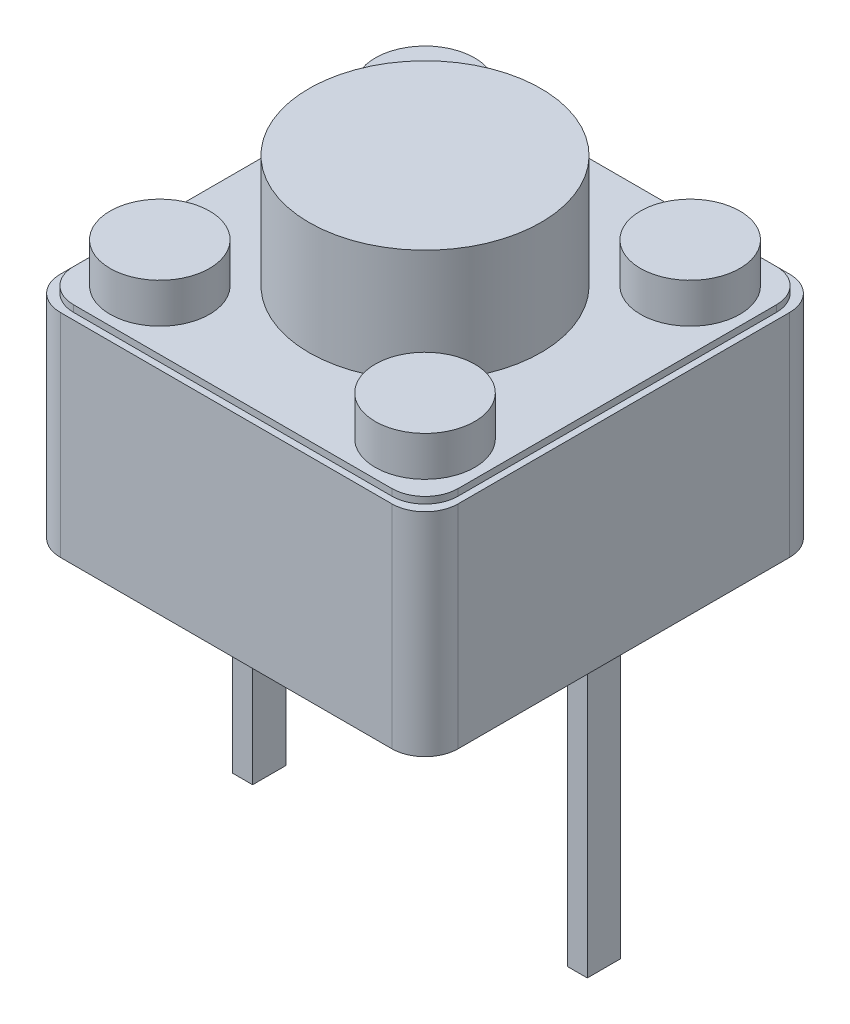
ISO-10303-21;
HEADER;
FILE_DESCRIPTION(('STEP AP214'),'2;1');
FILE_NAME('part.step','',(''),(''),'','','');
FILE_SCHEMA(('AUTOMOTIVE_DESIGN { 1 0 10303 214 1 1 1 1 }'));
ENDSEC;
DATA;
#1=APPLICATION_CONTEXT('core data for automotive mechanical design processes');
#2=APPLICATION_PROTOCOL_DEFINITION('international standard','automotive_design',2000,#1);
#3=PRODUCT_CONTEXT('',#1,'mechanical');
#4=PRODUCT('Part','Part','',(#3));
#5=PRODUCT_RELATED_PRODUCT_CATEGORY('part','',(#4));
#6=PRODUCT_DEFINITION_FORMATION('','',#4);
#7=PRODUCT_DEFINITION_CONTEXT('part definition',#1,'design');
#8=PRODUCT_DEFINITION('design','',#6,#7);
#9=PRODUCT_DEFINITION_SHAPE('','',#8);
#10=(LENGTH_UNIT() NAMED_UNIT(*) SI_UNIT(.MILLI.,.METRE.));
#11=(NAMED_UNIT(*) PLANE_ANGLE_UNIT() SI_UNIT($,.RADIAN.));
#12=(NAMED_UNIT(*) SI_UNIT($,.STERADIAN.) SOLID_ANGLE_UNIT());
#13=UNCERTAINTY_MEASURE_WITH_UNIT(LENGTH_MEASURE(1.E-05),#10,'distance_accuracy_value','');
#14=(GEOMETRIC_REPRESENTATION_CONTEXT(3) GLOBAL_UNCERTAINTY_ASSIGNED_CONTEXT((#13)) GLOBAL_UNIT_ASSIGNED_CONTEXT((#10,
#11,#12)) REPRESENTATION_CONTEXT('',''));
#15=CARTESIAN_POINT('',(0.,0.,0.));
#16=DIRECTION('',(0.,0.,1.));
#17=DIRECTION('',(1.,0.,0.));
#18=AXIS2_PLACEMENT_3D('',#15,#16,#17);
#19=CARTESIAN_POINT('',(-7.00000000000001,5.,-7.27272727272732));
#20=DIRECTION('',(0.,1.,0.));
#21=DIRECTION('',(0.,0.,1.));
#22=AXIS2_PLACEMENT_3D('',#19,#20,#21);
#23=PLANE('',#22);
#24=CARTESIAN_POINT('',(-7.00000000000001,5.,-7.27272727272732));
#25=DIRECTION('',(0.,1.,0.));
#26=DIRECTION('',(0.,0.,1.));
#27=AXIS2_PLACEMENT_3D('',#24,#25,#26);
#28=CIRCLE('',#27,1.75);
#29=CARTESIAN_POINT('',(-7.00000000000001,5.,-5.52272727272732));
#30=VERTEX_POINT('',#29);
#31=EDGE_CURVE('E11',#30,#30,#28,.T.);
#32=ORIENTED_EDGE('',*,*,#31,.T.);
#33=EDGE_LOOP('',(#32));
#34=FACE_BOUND('',#33,.T.);
#35=ADVANCED_FACE('F51',(#34),#23,.T.);
#36=CARTESIAN_POINT('',(-7.00000000000001,5.,-7.27272727272732));
#37=DIRECTION('',(0.,-1.,0.));
#38=DIRECTION('',(0.,0.,-1.));
#39=AXIS2_PLACEMENT_3D('',#36,#37,#38);
#40=CYLINDRICAL_SURFACE('',#39,1.75);
#41=ORIENTED_EDGE('',*,*,#31,.F.);
#42=EDGE_LOOP('',(#41));
#43=FACE_BOUND('',#42,.T.);
#44=CARTESIAN_POINT('',(-7.00000000000001,3.3,-7.27272727272732));
#45=DIRECTION('',(0.,1.,0.));
#46=DIRECTION('',(0.,0.,1.));
#47=AXIS2_PLACEMENT_3D('',#44,#45,#46);
#48=CIRCLE('',#47,1.75);
#49=CARTESIAN_POINT('',(-7.00000000000001,3.3,-5.52272727272732));
#50=VERTEX_POINT('',#49);
#51=EDGE_CURVE('E60',#50,#50,#48,.T.);
#52=ORIENTED_EDGE('',*,*,#51,.T.);
#53=EDGE_LOOP('',(#52));
#54=FACE_BOUND('',#53,.T.);
#55=ADVANCED_FACE('F53',(#43,#54),#40,.T.);
#56=CARTESIAN_POINT('',(-10.,3.4,-10.2727272727273));
#57=DIRECTION('',(1.,0.,0.));
#58=DIRECTION('',(0.,0.,-1.));
#59=AXIS2_PLACEMENT_3D('',#56,#57,#58);
#60=PLANE('',#59);
#61=DIRECTION('',(0.,0.,1.));
#62=VECTOR('',#61,1.);
#63=CARTESIAN_POINT('',(-10.,3.2,-10.2727272727273));
#64=LINE('',#63,#62);
#65=CARTESIAN_POINT('',(-10.,3.2,-9.77272727272731));
#66=VERTEX_POINT('',#65);
#67=CARTESIAN_POINT('',(-10.,3.2,-4.77272727272732));
#68=VERTEX_POINT('',#67);
#69=EDGE_CURVE('E303',#66,#68,#64,.T.);
#70=ORIENTED_EDGE('',*,*,#69,.F.);
#71=DIRECTION('',(0.,-1.,0.));
#72=VECTOR('',#71,1.);
#73=CARTESIAN_POINT('',(-10.,3.4,-9.77272727272731));
#74=LINE('',#73,#72);
#75=CARTESIAN_POINT('',(-10.,0.,-9.77272727272731));
#76=VERTEX_POINT('',#75);
#77=EDGE_CURVE('E343',#66,#76,#74,.T.);
#78=ORIENTED_EDGE('',*,*,#77,.T.);
#79=DIRECTION('',(0.,0.,1.));
#80=VECTOR('',#79,1.);
#81=CARTESIAN_POINT('',(-10.,0.,-10.2727272727273));
#82=LINE('',#81,#80);
#83=CARTESIAN_POINT('',(-10.,0.,-4.77272727272732));
#84=VERTEX_POINT('',#83);
#85=EDGE_CURVE('E284',#76,#84,#82,.T.);
#86=ORIENTED_EDGE('',*,*,#85,.T.);
#87=DIRECTION('',(0.,-1.,0.));
#88=VECTOR('',#87,1.);
#89=CARTESIAN_POINT('',(-10.,3.4,-4.77272727272732));
#90=LINE('',#89,#88);
#91=EDGE_CURVE('E341',#84,#68,#90,.F.);
#92=ORIENTED_EDGE('',*,*,#91,.T.);
#93=EDGE_LOOP('',(#70,#78,#86,#92));
#94=FACE_BOUND('',#93,.T.);
#95=ADVANCED_FACE('F463',(#94),#60,.F.);
#96=CARTESIAN_POINT('',(-10.,3.4,-4.27272727272732));
#97=DIRECTION('',(0.,0.,-1.));
#98=DIRECTION('',(-1.,0.,0.));
#99=AXIS2_PLACEMENT_3D('',#96,#97,#98);
#100=PLANE('',#99);
#101=DIRECTION('',(1.,0.,0.));
#102=VECTOR('',#101,1.);
#103=CARTESIAN_POINT('',(-10.,3.2,-4.27272727272732));
#104=LINE('',#103,#102);
#105=CARTESIAN_POINT('',(-9.50000000000001,3.2,-4.27272727272732));
#106=VERTEX_POINT('',#105);
#107=CARTESIAN_POINT('',(-4.50000000000001,3.2,-4.27272727272732));
#108=VERTEX_POINT('',#107);
#109=EDGE_CURVE('E301',#106,#108,#104,.T.);
#110=ORIENTED_EDGE('',*,*,#109,.F.);
#111=DIRECTION('',(0.,-1.,0.));
#112=VECTOR('',#111,1.);
#113=CARTESIAN_POINT('',(-9.50000000000001,3.4,-4.27272727272732));
#114=LINE('',#113,#112);
#115=CARTESIAN_POINT('',(-9.50000000000001,0.,-4.27272727272732));
#116=VERTEX_POINT('',#115);
#117=EDGE_CURVE('E372',#106,#116,#114,.T.);
#118=ORIENTED_EDGE('',*,*,#117,.T.);
#119=DIRECTION('',(1.,0.,0.));
#120=VECTOR('',#119,1.);
#121=CARTESIAN_POINT('',(-10.,0.,-4.27272727272732));
#122=LINE('',#121,#120);
#123=CARTESIAN_POINT('',(-4.50000000000001,0.,-4.27272727272732));
#124=VERTEX_POINT('',#123);
#125=EDGE_CURVE('E287',#116,#124,#122,.T.);
#126=ORIENTED_EDGE('',*,*,#125,.T.);
#127=DIRECTION('',(0.,-1.,0.));
#128=VECTOR('',#127,1.);
#129=CARTESIAN_POINT('',(-4.50000000000001,3.4,-4.27272727272732));
#130=LINE('',#129,#128);
#131=EDGE_CURVE('E370',#124,#108,#130,.F.);
#132=ORIENTED_EDGE('',*,*,#131,.T.);
#133=EDGE_LOOP('',(#110,#118,#126,#132));
#134=FACE_BOUND('',#133,.T.);
#135=ADVANCED_FACE('F500',(#134),#100,.F.);
#136=CARTESIAN_POINT('',(-4.00000000000001,3.4,-10.2727272727273));
#137=DIRECTION('',(-1.,0.,0.));
#138=DIRECTION('',(0.,0.,1.));
#139=AXIS2_PLACEMENT_3D('',#136,#137,#138);
#140=PLANE('',#139);
#141=DIRECTION('',(0.,0.,-1.));
#142=VECTOR('',#141,1.);
#143=CARTESIAN_POINT('',(-4.00000000000001,0.,-10.2727272727273));
#144=LINE('',#143,#142);
#145=CARTESIAN_POINT('',(-4.00000000000001,0.,-4.77272727272732));
#146=VERTEX_POINT('',#145);
#147=CARTESIAN_POINT('',(-4.00000000000001,0.,-9.77272727272731));
#148=VERTEX_POINT('',#147);
#149=EDGE_CURVE('E291',#146,#148,#144,.T.);
#150=ORIENTED_EDGE('',*,*,#149,.T.);
#151=DIRECTION('',(0.,-1.,0.));
#152=VECTOR('',#151,1.);
#153=CARTESIAN_POINT('',(-4.00000000000001,3.4,-9.77272727272731));
#154=LINE('',#153,#152);
#155=CARTESIAN_POINT('',(-4.00000000000001,3.2,-9.77272727272731));
#156=VERTEX_POINT('',#155);
#157=EDGE_CURVE('E67',#148,#156,#154,.F.);
#158=ORIENTED_EDGE('',*,*,#157,.T.);
#159=DIRECTION('',(0.,0.,-1.));
#160=VECTOR('',#159,1.);
#161=CARTESIAN_POINT('',(-4.00000000000001,3.2,-10.2727272727273));
#162=LINE('',#161,#160);
#163=CARTESIAN_POINT('',(-4.00000000000001,3.2,-4.77272727272732));
#164=VERTEX_POINT('',#163);
#165=EDGE_CURVE('E299',#164,#156,#162,.T.);
#166=ORIENTED_EDGE('',*,*,#165,.F.);
#167=DIRECTION('',(0.,-1.,0.));
#168=VECTOR('',#167,1.);
#169=CARTESIAN_POINT('',(-4.00000000000001,3.4,-4.77272727272732));
#170=LINE('',#169,#168);
#171=EDGE_CURVE('E366',#164,#146,#170,.T.);
#172=ORIENTED_EDGE('',*,*,#171,.T.);
#173=EDGE_LOOP('',(#150,#158,#166,#172));
#174=FACE_BOUND('',#173,.T.);
#175=ADVANCED_FACE('F454',(#174),#140,.F.);
#176=CARTESIAN_POINT('',(-10.,3.4,-10.2727272727273));
#177=DIRECTION('',(0.,0.,1.));
#178=DIRECTION('',(1.,0.,0.));
#179=AXIS2_PLACEMENT_3D('',#176,#177,#178);
#180=PLANE('',#179);
#181=DIRECTION('',(-1.,0.,0.));
#182=VECTOR('',#181,1.);
#183=CARTESIAN_POINT('',(-10.,0.,-10.2727272727273));
#184=LINE('',#183,#182);
#185=CARTESIAN_POINT('',(-4.50000000000001,0.,-10.2727272727273));
#186=VERTEX_POINT('',#185);
#187=CARTESIAN_POINT('',(-9.50000000000001,0.,-10.2727272727273));
#188=VERTEX_POINT('',#187);
#189=EDGE_CURVE('E264',#186,#188,#184,.T.);
#190=ORIENTED_EDGE('',*,*,#189,.T.);
#191=DIRECTION('',(0.,-1.,0.));
#192=VECTOR('',#191,1.);
#193=CARTESIAN_POINT('',(-9.50000000000001,3.4,-10.2727272727273));
#194=LINE('',#193,#192);
#195=CARTESIAN_POINT('',(-9.50000000000001,3.2,-10.2727272727273));
#196=VERTEX_POINT('',#195);
#197=EDGE_CURVE('E357',#188,#196,#194,.F.);
#198=ORIENTED_EDGE('',*,*,#197,.T.);
#199=DIRECTION('',(-1.,0.,0.));
#200=VECTOR('',#199,1.);
#201=CARTESIAN_POINT('',(-10.,3.2,-10.2727272727273));
#202=LINE('',#201,#200);
#203=CARTESIAN_POINT('',(-4.50000000000001,3.2,-10.2727272727273));
#204=VERTEX_POINT('',#203);
#205=EDGE_CURVE('E295',#204,#196,#202,.T.);
#206=ORIENTED_EDGE('',*,*,#205,.F.);
#207=DIRECTION('',(0.,-1.,0.));
#208=VECTOR('',#207,1.);
#209=CARTESIAN_POINT('',(-4.50000000000001,3.4,-10.2727272727273));
#210=LINE('',#209,#208);
#211=EDGE_CURVE('E354',#204,#186,#210,.T.);
#212=ORIENTED_EDGE('',*,*,#211,.T.);
#213=EDGE_LOOP('',(#190,#198,#206,#212));
#214=FACE_BOUND('',#213,.T.);
#215=ADVANCED_FACE('F443',(#214),#180,.F.);
#216=CARTESIAN_POINT('',(0.,0.,0.));
#217=DIRECTION('',(0.,1.,0.));
#218=DIRECTION('',(0.,0.,1.));
#219=AXIS2_PLACEMENT_3D('',#216,#217,#218);
#220=PLANE('',#219);
#221=DIRECTION('',(0.,0.,-1.));
#222=VECTOR('',#221,1.);
#223=CARTESIAN_POINT('',(-9.65000000000001,0.,-7.52272727272731));
#224=LINE('',#223,#222);
#225=CARTESIAN_POINT('',(-9.65000000000001,0.,-7.02272727272731));
#226=VERTEX_POINT('',#225);
#227=CARTESIAN_POINT('',(-9.65000000000001,0.,-7.52272727272731));
#228=VERTEX_POINT('',#227);
#229=EDGE_CURVE('E260',#226,#228,#224,.T.);
#230=ORIENTED_EDGE('',*,*,#229,.F.);
#231=DIRECTION('',(-1.,0.,0.));
#232=VECTOR('',#231,1.);
#233=CARTESIAN_POINT('',(-9.35000000000001,0.,-7.02272727272731));
#234=LINE('',#233,#232);
#235=CARTESIAN_POINT('',(-9.35000000000001,0.,-7.02272727272731));
#236=VERTEX_POINT('',#235);
#237=EDGE_CURVE('E273',#236,#226,#234,.T.);
#238=ORIENTED_EDGE('',*,*,#237,.F.);
#239=DIRECTION('',(0.,0.,1.));
#240=VECTOR('',#239,1.);
#241=CARTESIAN_POINT('',(-9.35000000000001,0.,-7.52272727272731));
#242=LINE('',#241,#240);
#243=CARTESIAN_POINT('',(-9.35000000000001,0.,-7.52272727272731));
#244=VERTEX_POINT('',#243);
#245=EDGE_CURVE('E269',#244,#236,#242,.T.);
#246=ORIENTED_EDGE('',*,*,#245,.F.);
#247=DIRECTION('',(1.,0.,0.));
#248=VECTOR('',#247,1.);
#249=CARTESIAN_POINT('',(-9.35000000000001,0.,-7.52272727272731));
#250=LINE('',#249,#248);
#251=EDGE_CURVE('E265',#228,#244,#250,.T.);
#252=ORIENTED_EDGE('',*,*,#251,.F.);
#253=EDGE_LOOP('',(#230,#238,#246,#252));
#254=FACE_BOUND('',#253,.T.);
#255=ORIENTED_EDGE('',*,*,#85,.F.);
#256=CARTESIAN_POINT('',(-9.50000000000001,0.,-9.77272727272731));
#257=DIRECTION('',(0.,1.,0.));
#258=DIRECTION('',(0.,0.,1.));
#259=AXIS2_PLACEMENT_3D('',#256,#257,#258);
#260=CIRCLE('',#259,0.5);
#261=EDGE_CURVE('E352',#76,#188,#260,.F.);
#262=ORIENTED_EDGE('',*,*,#261,.T.);
#263=ORIENTED_EDGE('',*,*,#189,.F.);
#264=CARTESIAN_POINT('',(-4.50000000000001,0.,-9.77272727272731));
#265=DIRECTION('',(0.,1.,0.));
#266=DIRECTION('',(0.,0.,1.));
#267=AXIS2_PLACEMENT_3D('',#264,#265,#266);
#268=CIRCLE('',#267,0.5);
#269=EDGE_CURVE('E350',#186,#148,#268,.F.);
#270=ORIENTED_EDGE('',*,*,#269,.T.);
#271=ORIENTED_EDGE('',*,*,#149,.F.);
#272=CARTESIAN_POINT('',(-4.50000000000001,0.,-4.77272727272732));
#273=DIRECTION('',(0.,1.,0.));
#274=DIRECTION('',(0.,0.,1.));
#275=AXIS2_PLACEMENT_3D('',#272,#273,#274);
#276=CIRCLE('',#275,0.5);
#277=EDGE_CURVE('E346',#146,#124,#276,.F.);
#278=ORIENTED_EDGE('',*,*,#277,.T.);
#279=ORIENTED_EDGE('',*,*,#125,.F.);
#280=CARTESIAN_POINT('',(-9.50000000000001,0.,-4.77272727272732));
#281=DIRECTION('',(0.,1.,0.));
#282=DIRECTION('',(0.,0.,1.));
#283=AXIS2_PLACEMENT_3D('',#280,#281,#282);
#284=CIRCLE('',#283,0.5);
#285=EDGE_CURVE('E348',#116,#84,#284,.F.);
#286=ORIENTED_EDGE('',*,*,#285,.T.);
#287=EDGE_LOOP('',(#255,#262,#263,#270,#271,#278,#279,#286));
#288=FACE_BOUND('',#287,.T.);
#289=DIRECTION('',(0.,0.,-1.));
#290=VECTOR('',#289,1.);
#291=CARTESIAN_POINT('',(-4.60208585615651,0.,-7.52272727272731));
#292=LINE('',#291,#290);
#293=CARTESIAN_POINT('',(-4.60208585615651,0.,-7.02272727272731));
#294=VERTEX_POINT('',#293);
#295=CARTESIAN_POINT('',(-4.60208585615651,0.,-7.52272727272731));
#296=VERTEX_POINT('',#295);
#297=EDGE_CURVE('E239',#294,#296,#292,.T.);
#298=ORIENTED_EDGE('',*,*,#297,.F.);
#299=DIRECTION('',(-1.,0.,0.));
#300=VECTOR('',#299,1.);
#301=CARTESIAN_POINT('',(-4.30208585615651,0.,-7.02272727272731));
#302=LINE('',#301,#300);
#303=CARTESIAN_POINT('',(-4.30208585615651,0.,-7.02272727272731));
#304=VERTEX_POINT('',#303);
#305=EDGE_CURVE('E430',#304,#294,#302,.T.);
#306=ORIENTED_EDGE('',*,*,#305,.F.);
#307=DIRECTION('',(0.,0.,1.));
#308=VECTOR('',#307,1.);
#309=CARTESIAN_POINT('',(-4.30208585615651,0.,-7.52272727272731));
#310=LINE('',#309,#308);
#311=CARTESIAN_POINT('',(-4.30208585615651,0.,-7.52272727272731));
#312=VERTEX_POINT('',#311);
#313=EDGE_CURVE('E240',#312,#304,#310,.T.);
#314=ORIENTED_EDGE('',*,*,#313,.F.);
#315=DIRECTION('',(1.,0.,0.));
#316=VECTOR('',#315,1.);
#317=CARTESIAN_POINT('',(-4.30208585615651,0.,-7.52272727272731));
#318=LINE('',#317,#316);
#319=EDGE_CURVE('E241',#296,#312,#318,.T.);
#320=ORIENTED_EDGE('',*,*,#319,.F.);
#321=EDGE_LOOP('',(#298,#306,#314,#320));
#322=FACE_BOUND('',#321,.T.);
#323=ADVANCED_FACE('F440',(#254,#288,#322),#220,.F.);
#324=CARTESIAN_POINT('',(-9.65000000000001,-4.27,-7.52272727272731));
#325=DIRECTION('',(1.,0.,0.));
#326=DIRECTION('',(0.,0.,-1.));
#327=AXIS2_PLACEMENT_3D('',#324,#325,#326);
#328=PLANE('',#327);
#329=ORIENTED_EDGE('',*,*,#229,.T.);
#330=DIRECTION('',(0.,1.,0.));
#331=VECTOR('',#330,1.);
#332=CARTESIAN_POINT('',(-9.65000000000001,-4.27,-7.52272727272731));
#333=LINE('',#332,#331);
#334=CARTESIAN_POINT('',(-9.65000000000001,-4.27,-7.52272727272731));
#335=VERTEX_POINT('',#334);
#336=EDGE_CURVE('E268',#335,#228,#333,.T.);
#337=ORIENTED_EDGE('',*,*,#336,.F.);
#338=DIRECTION('',(0.,0.,-1.));
#339=VECTOR('',#338,1.);
#340=CARTESIAN_POINT('',(-9.65000000000001,-4.27,-7.52272727272731));
#341=LINE('',#340,#339);
#342=CARTESIAN_POINT('',(-9.65000000000001,-4.27,-7.02272727272731));
#343=VERTEX_POINT('',#342);
#344=EDGE_CURVE('E250',#343,#335,#341,.T.);
#345=ORIENTED_EDGE('',*,*,#344,.F.);
#346=DIRECTION('',(0.,1.,0.));
#347=VECTOR('',#346,1.);
#348=CARTESIAN_POINT('',(-9.65000000000001,-4.27,-7.02272727272731));
#349=LINE('',#348,#347);
#350=EDGE_CURVE('E263',#343,#226,#349,.T.);
#351=ORIENTED_EDGE('',*,*,#350,.T.);
#352=EDGE_LOOP('',(#329,#337,#345,#351));
#353=FACE_BOUND('',#352,.T.);
#354=ADVANCED_FACE('F442',(#353),#328,.F.);
#355=CARTESIAN_POINT('',(-9.35000000000001,-4.27,-7.52272727272731));
#356=DIRECTION('',(0.,0.,1.));
#357=DIRECTION('',(1.,0.,0.));
#358=AXIS2_PLACEMENT_3D('',#355,#356,#357);
#359=PLANE('',#358);
#360=ORIENTED_EDGE('',*,*,#251,.T.);
#361=DIRECTION('',(0.,1.,0.));
#362=VECTOR('',#361,1.);
#363=CARTESIAN_POINT('',(-9.35000000000001,-4.27,-7.52272727272731));
#364=LINE('',#363,#362);
#365=CARTESIAN_POINT('',(-9.35000000000001,-4.27,-7.52272727272731));
#366=VERTEX_POINT('',#365);
#367=EDGE_CURVE('E272',#366,#244,#364,.T.);
#368=ORIENTED_EDGE('',*,*,#367,.F.);
#369=DIRECTION('',(1.,0.,0.));
#370=VECTOR('',#369,1.);
#371=CARTESIAN_POINT('',(-9.35000000000001,-4.27,-7.52272727272731));
#372=LINE('',#371,#370);
#373=EDGE_CURVE('E253',#335,#366,#372,.T.);
#374=ORIENTED_EDGE('',*,*,#373,.F.);
#375=ORIENTED_EDGE('',*,*,#336,.T.);
#376=EDGE_LOOP('',(#360,#368,#374,#375));
#377=FACE_BOUND('',#376,.T.);
#378=ADVANCED_FACE('F451',(#377),#359,.F.);
#379=CARTESIAN_POINT('',(-9.35000000000001,-4.27,-7.52272727272731));
#380=DIRECTION('',(-1.,0.,0.));
#381=DIRECTION('',(0.,0.,1.));
#382=AXIS2_PLACEMENT_3D('',#379,#380,#381);
#383=PLANE('',#382);
#384=ORIENTED_EDGE('',*,*,#245,.T.);
#385=DIRECTION('',(0.,1.,0.));
#386=VECTOR('',#385,1.);
#387=CARTESIAN_POINT('',(-9.35000000000001,-4.27,-7.02272727272731));
#388=LINE('',#387,#386);
#389=CARTESIAN_POINT('',(-9.35000000000001,-4.27,-7.02272727272731));
#390=VERTEX_POINT('',#389);
#391=EDGE_CURVE('E254',#390,#236,#388,.T.);
#392=ORIENTED_EDGE('',*,*,#391,.F.);
#393=DIRECTION('',(0.,0.,1.));
#394=VECTOR('',#393,1.);
#395=CARTESIAN_POINT('',(-9.35000000000001,-4.27,-7.52272727272731));
#396=LINE('',#395,#394);
#397=EDGE_CURVE('E256',#366,#390,#396,.T.);
#398=ORIENTED_EDGE('',*,*,#397,.F.);
#399=ORIENTED_EDGE('',*,*,#367,.T.);
#400=EDGE_LOOP('',(#384,#392,#398,#399));
#401=FACE_BOUND('',#400,.T.);
#402=ADVANCED_FACE('F826',(#401),#383,.F.);
#403=CARTESIAN_POINT('',(-9.35000000000001,-4.27,-7.02272727272731));
#404=DIRECTION('',(0.,0.,-1.));
#405=DIRECTION('',(-1.,0.,0.));
#406=AXIS2_PLACEMENT_3D('',#403,#404,#405);
#407=PLANE('',#406);
#408=ORIENTED_EDGE('',*,*,#237,.T.);
#409=ORIENTED_EDGE('',*,*,#350,.F.);
#410=DIRECTION('',(-1.,0.,0.));
#411=VECTOR('',#410,1.);
#412=CARTESIAN_POINT('',(-9.35000000000001,-4.27,-7.02272727272731));
#413=LINE('',#412,#411);
#414=EDGE_CURVE('E258',#390,#343,#413,.T.);
#415=ORIENTED_EDGE('',*,*,#414,.F.);
#416=ORIENTED_EDGE('',*,*,#391,.T.);
#417=EDGE_LOOP('',(#408,#409,#415,#416));
#418=FACE_BOUND('',#417,.T.);
#419=ADVANCED_FACE('F818',(#418),#407,.F.);
#420=CARTESIAN_POINT('',(0.,-4.27,0.));
#421=DIRECTION('',(0.,-1.,0.));
#422=DIRECTION('',(0.,0.,-1.));
#423=AXIS2_PLACEMENT_3D('',#420,#421,#422);
#424=PLANE('',#423);
#425=ORIENTED_EDGE('',*,*,#344,.T.);
#426=ORIENTED_EDGE('',*,*,#373,.T.);
#427=ORIENTED_EDGE('',*,*,#397,.T.);
#428=ORIENTED_EDGE('',*,*,#414,.T.);
#429=EDGE_LOOP('',(#425,#426,#427,#428));
#430=FACE_BOUND('',#429,.T.);
#431=ADVANCED_FACE('F811',(#430),#424,.T.);
#432=CARTESIAN_POINT('',(-4.60208585615651,-4.27,-7.52272727272731));
#433=DIRECTION('',(1.,0.,0.));
#434=DIRECTION('',(0.,0.,-1.));
#435=AXIS2_PLACEMENT_3D('',#432,#433,#434);
#436=PLANE('',#435);
#437=ORIENTED_EDGE('',*,*,#297,.T.);
#438=DIRECTION('',(0.,1.,0.));
#439=VECTOR('',#438,1.);
#440=CARTESIAN_POINT('',(-4.60208585615651,-4.27,-7.52272727272731));
#441=LINE('',#440,#439);
#442=CARTESIAN_POINT('',(-4.60208585615651,-4.27,-7.52272727272731));
#443=VERTEX_POINT('',#442);
#444=EDGE_CURVE('E220',#443,#296,#441,.T.);
#445=ORIENTED_EDGE('',*,*,#444,.F.);
#446=DIRECTION('',(0.,0.,-1.));
#447=VECTOR('',#446,1.);
#448=CARTESIAN_POINT('',(-4.60208585615651,-4.27,-7.52272727272731));
#449=LINE('',#448,#447);
#450=CARTESIAN_POINT('',(-4.60208585615651,-4.27,-7.02272727272731));
#451=VERTEX_POINT('',#450);
#452=EDGE_CURVE('E227',#451,#443,#449,.T.);
#453=ORIENTED_EDGE('',*,*,#452,.F.);
#454=DIRECTION('',(0.,1.,0.));
#455=VECTOR('',#454,1.);
#456=CARTESIAN_POINT('',(-4.60208585615651,-4.27,-7.02272727272731));
#457=LINE('',#456,#455);
#458=EDGE_CURVE('E245',#451,#294,#457,.T.);
#459=ORIENTED_EDGE('',*,*,#458,.T.);
#460=EDGE_LOOP('',(#437,#445,#453,#459));
#461=FACE_BOUND('',#460,.T.);
#462=ADVANCED_FACE('F238',(#461),#436,.F.);
#463=CARTESIAN_POINT('',(-4.30208585615651,-4.27,-7.52272727272731));
#464=DIRECTION('',(0.,0.,1.));
#465=DIRECTION('',(1.,0.,0.));
#466=AXIS2_PLACEMENT_3D('',#463,#464,#465);
#467=PLANE('',#466);
#468=ORIENTED_EDGE('',*,*,#319,.T.);
#469=DIRECTION('',(0.,1.,0.));
#470=VECTOR('',#469,1.);
#471=CARTESIAN_POINT('',(-4.30208585615651,-4.27,-7.52272727272731));
#472=LINE('',#471,#470);
#473=CARTESIAN_POINT('',(-4.30208585615651,-4.27,-7.52272727272731));
#474=VERTEX_POINT('',#473);
#475=EDGE_CURVE('E223',#474,#312,#472,.T.);
#476=ORIENTED_EDGE('',*,*,#475,.F.);
#477=DIRECTION('',(1.,0.,0.));
#478=VECTOR('',#477,1.);
#479=CARTESIAN_POINT('',(-4.30208585615651,-4.27,-7.52272727272731));
#480=LINE('',#479,#478);
#481=EDGE_CURVE('E215',#443,#474,#480,.T.);
#482=ORIENTED_EDGE('',*,*,#481,.F.);
#483=ORIENTED_EDGE('',*,*,#444,.T.);
#484=EDGE_LOOP('',(#468,#476,#482,#483));
#485=FACE_BOUND('',#484,.T.);
#486=ADVANCED_FACE('F218',(#485),#467,.F.);
#487=CARTESIAN_POINT('',(-4.30208585615651,-4.27,-7.52272727272731));
#488=DIRECTION('',(-1.,0.,0.));
#489=DIRECTION('',(0.,0.,1.));
#490=AXIS2_PLACEMENT_3D('',#487,#488,#489);
#491=PLANE('',#490);
#492=ORIENTED_EDGE('',*,*,#313,.T.);
#493=DIRECTION('',(0.,1.,0.));
#494=VECTOR('',#493,1.);
#495=CARTESIAN_POINT('',(-4.30208585615651,-4.27,-7.02272727272731));
#496=LINE('',#495,#494);
#497=CARTESIAN_POINT('',(-4.30208585615651,-4.27,-7.02272727272731));
#498=VERTEX_POINT('',#497);
#499=EDGE_CURVE('E236',#498,#304,#496,.T.);
#500=ORIENTED_EDGE('',*,*,#499,.F.);
#501=DIRECTION('',(0.,0.,1.));
#502=VECTOR('',#501,1.);
#503=CARTESIAN_POINT('',(-4.30208585615651,-4.27,-7.52272727272731));
#504=LINE('',#503,#502);
#505=EDGE_CURVE('E226',#474,#498,#504,.T.);
#506=ORIENTED_EDGE('',*,*,#505,.F.);
#507=ORIENTED_EDGE('',*,*,#475,.T.);
#508=EDGE_LOOP('',(#492,#500,#506,#507));
#509=FACE_BOUND('',#508,.T.);
#510=ADVANCED_FACE('F438',(#509),#491,.F.);
#511=CARTESIAN_POINT('',(-4.30208585615651,-4.27,-7.02272727272731));
#512=DIRECTION('',(0.,0.,-1.));
#513=DIRECTION('',(-1.,0.,0.));
#514=AXIS2_PLACEMENT_3D('',#511,#512,#513);
#515=PLANE('',#514);
#516=ORIENTED_EDGE('',*,*,#305,.T.);
#517=ORIENTED_EDGE('',*,*,#458,.F.);
#518=DIRECTION('',(-1.,0.,0.));
#519=VECTOR('',#518,1.);
#520=CARTESIAN_POINT('',(-4.30208585615651,-4.27,-7.02272727272731));
#521=LINE('',#520,#519);
#522=EDGE_CURVE('E232',#498,#451,#521,.T.);
#523=ORIENTED_EDGE('',*,*,#522,.F.);
#524=ORIENTED_EDGE('',*,*,#499,.T.);
#525=EDGE_LOOP('',(#516,#517,#523,#524));
#526=FACE_BOUND('',#525,.T.);
#527=ADVANCED_FACE('F436',(#526),#515,.F.);
#528=CARTESIAN_POINT('',(0.,-4.27,0.));
#529=DIRECTION('',(0.,-1.,0.));
#530=DIRECTION('',(0.,0.,-1.));
#531=AXIS2_PLACEMENT_3D('',#528,#529,#530);
#532=PLANE('',#531);
#533=ORIENTED_EDGE('',*,*,#452,.T.);
#534=ORIENTED_EDGE('',*,*,#481,.T.);
#535=ORIENTED_EDGE('',*,*,#505,.T.);
#536=ORIENTED_EDGE('',*,*,#522,.T.);
#537=EDGE_LOOP('',(#533,#534,#535,#536));
#538=FACE_BOUND('',#537,.T.);
#539=ADVANCED_FACE('F230',(#538),#532,.T.);
#540=CARTESIAN_POINT('',(0.,3.2,0.));
#541=DIRECTION('',(0.,1.,0.));
#542=DIRECTION('',(0.,0.,1.));
#543=AXIS2_PLACEMENT_3D('',#540,#541,#542);
#544=PLANE('',#543);
#545=DIRECTION('',(0.,0.,1.));
#546=VECTOR('',#545,1.);
#547=CARTESIAN_POINT('',(-9.90000000000001,3.2,-10.1727272727273));
#548=LINE('',#547,#546);
#549=CARTESIAN_POINT('',(-9.90000000000001,3.2,-9.67272727272731));
#550=VERTEX_POINT('',#549);
#551=CARTESIAN_POINT('',(-9.90000000000001,3.2,-4.87272727272731));
#552=VERTEX_POINT('',#551);
#553=EDGE_CURVE('E404',#550,#552,#548,.T.);
#554=ORIENTED_EDGE('',*,*,#553,.F.);
#555=CARTESIAN_POINT('',(-9.40000000000001,3.2,-9.67272727272731));
#556=DIRECTION('',(0.,1.,0.));
#557=DIRECTION('',(0.,0.,1.));
#558=AXIS2_PLACEMENT_3D('',#555,#556,#557);
#559=CIRCLE('',#558,0.5);
#560=CARTESIAN_POINT('',(-9.40000000000001,3.2,-10.1727272727273));
#561=VERTEX_POINT('',#560);
#562=EDGE_CURVE('E333',#550,#561,#559,.F.);
#563=ORIENTED_EDGE('',*,*,#562,.T.);
#564=DIRECTION('',(-1.,0.,0.));
#565=VECTOR('',#564,1.);
#566=CARTESIAN_POINT('',(-9.90000000000001,3.2,-10.1727272727273));
#567=LINE('',#566,#565);
#568=CARTESIAN_POINT('',(-4.60000000000001,3.2,-10.1727272727273));
#569=VERTEX_POINT('',#568);
#570=EDGE_CURVE('E425',#569,#561,#567,.T.);
#571=ORIENTED_EDGE('',*,*,#570,.F.);
#572=CARTESIAN_POINT('',(-4.60000000000001,3.2,-9.67272727272731));
#573=DIRECTION('',(0.,1.,0.));
#574=DIRECTION('',(0.,0.,1.));
#575=AXIS2_PLACEMENT_3D('',#572,#573,#574);
#576=CIRCLE('',#575,0.5);
#577=CARTESIAN_POINT('',(-4.10000000000001,3.2,-9.67272727272731));
#578=VERTEX_POINT('',#577);
#579=EDGE_CURVE('E339',#569,#578,#576,.F.);
#580=ORIENTED_EDGE('',*,*,#579,.T.);
#581=DIRECTION('',(0.,0.,-1.));
#582=VECTOR('',#581,1.);
#583=CARTESIAN_POINT('',(-4.10000000000001,3.2,-10.1727272727273));
#584=LINE('',#583,#582);
#585=CARTESIAN_POINT('',(-4.10000000000001,3.2,-4.87272727272731));
#586=VERTEX_POINT('',#585);
#587=EDGE_CURVE('E416',#586,#578,#584,.T.);
#588=ORIENTED_EDGE('',*,*,#587,.F.);
#589=CARTESIAN_POINT('',(-4.60000000000001,3.2,-4.87272727272731));
#590=DIRECTION('',(0.,1.,0.));
#591=DIRECTION('',(0.,0.,1.));
#592=AXIS2_PLACEMENT_3D('',#589,#590,#591);
#593=CIRCLE('',#592,0.5);
#594=CARTESIAN_POINT('',(-4.60000000000001,3.2,-4.37272727272732));
#595=VERTEX_POINT('',#594);
#596=EDGE_CURVE('E337',#586,#595,#593,.F.);
#597=ORIENTED_EDGE('',*,*,#596,.T.);
#598=DIRECTION('',(1.,0.,0.));
#599=VECTOR('',#598,1.);
#600=CARTESIAN_POINT('',(-9.90000000000001,3.2,-4.37272727272732));
#601=LINE('',#600,#599);
#602=CARTESIAN_POINT('',(-9.40000000000001,3.2,-4.37272727272732));
#603=VERTEX_POINT('',#602);
#604=EDGE_CURVE('E412',#603,#595,#601,.T.);
#605=ORIENTED_EDGE('',*,*,#604,.F.);
#606=CARTESIAN_POINT('',(-9.40000000000001,3.2,-4.87272727272731));
#607=DIRECTION('',(0.,1.,0.));
#608=DIRECTION('',(0.,0.,1.));
#609=AXIS2_PLACEMENT_3D('',#606,#607,#608);
#610=CIRCLE('',#609,0.5);
#611=EDGE_CURVE('E335',#603,#552,#610,.F.);
#612=ORIENTED_EDGE('',*,*,#611,.T.);
#613=EDGE_LOOP('',(#554,#563,#571,#580,#588,#597,#605,#612));
#614=FACE_BOUND('',#613,.T.);
#615=ORIENTED_EDGE('',*,*,#205,.T.);
#616=CARTESIAN_POINT('',(-9.50000000000001,3.2,-9.77272727272731));
#617=DIRECTION('',(0.,1.,0.));
#618=DIRECTION('',(0.,0.,1.));
#619=AXIS2_PLACEMENT_3D('',#616,#617,#618);
#620=CIRCLE('',#619,0.5);
#621=EDGE_CURVE('E364',#196,#66,#620,.T.);
#622=ORIENTED_EDGE('',*,*,#621,.T.);
#623=ORIENTED_EDGE('',*,*,#69,.T.);
#624=CARTESIAN_POINT('',(-9.50000000000001,3.2,-4.77272727272732));
#625=DIRECTION('',(0.,1.,0.));
#626=DIRECTION('',(0.,0.,1.));
#627=AXIS2_PLACEMENT_3D('',#624,#625,#626);
#628=CIRCLE('',#627,0.5);
#629=EDGE_CURVE('E360',#68,#106,#628,.T.);
#630=ORIENTED_EDGE('',*,*,#629,.T.);
#631=ORIENTED_EDGE('',*,*,#109,.T.);
#632=CARTESIAN_POINT('',(-4.50000000000001,3.2,-4.77272727272732));
#633=DIRECTION('',(0.,1.,0.));
#634=DIRECTION('',(0.,0.,1.));
#635=AXIS2_PLACEMENT_3D('',#632,#633,#634);
#636=CIRCLE('',#635,0.5);
#637=EDGE_CURVE('E74',#108,#164,#636,.T.);
#638=ORIENTED_EDGE('',*,*,#637,.T.);
#639=ORIENTED_EDGE('',*,*,#165,.T.);
#640=CARTESIAN_POINT('',(-4.50000000000001,3.2,-9.77272727272731));
#641=DIRECTION('',(0.,1.,0.));
#642=DIRECTION('',(0.,0.,1.));
#643=AXIS2_PLACEMENT_3D('',#640,#641,#642);
#644=CIRCLE('',#643,0.5);
#645=EDGE_CURVE('E362',#156,#204,#644,.T.);
#646=ORIENTED_EDGE('',*,*,#645,.T.);
#647=EDGE_LOOP('',(#615,#622,#623,#630,#631,#638,#639,#646));
#648=FACE_BOUND('',#647,.T.);
#649=ADVANCED_FACE('F408',(#614,#648),#544,.T.);
#650=CARTESIAN_POINT('',(-9.90000000000001,3.3,-10.1727272727273));
#651=DIRECTION('',(1.,0.,0.));
#652=DIRECTION('',(0.,0.,-1.));
#653=AXIS2_PLACEMENT_3D('',#650,#651,#652);
#654=PLANE('',#653);
#655=DIRECTION('',(0.,0.,1.));
#656=VECTOR('',#655,1.);
#657=CARTESIAN_POINT('',(-9.90000000000001,3.3,-10.1727272727273));
#658=LINE('',#657,#656);
#659=CARTESIAN_POINT('',(-9.90000000000001,3.3,-9.67272727272731));
#660=VERTEX_POINT('',#659);
#661=CARTESIAN_POINT('',(-9.90000000000001,3.3,-4.87272727272731));
#662=VERTEX_POINT('',#661);
#663=EDGE_CURVE('E406',#660,#662,#658,.T.);
#664=ORIENTED_EDGE('',*,*,#663,.F.);
#665=DIRECTION('',(0.,-1.,0.));
#666=VECTOR('',#665,1.);
#667=CARTESIAN_POINT('',(-9.90000000000001,3.3,-9.67272727272731));
#668=LINE('',#667,#666);
#669=EDGE_CURVE('E307',#660,#550,#668,.T.);
#670=ORIENTED_EDGE('',*,*,#669,.T.);
#671=ORIENTED_EDGE('',*,*,#553,.T.);
#672=DIRECTION('',(0.,-1.,0.));
#673=VECTOR('',#672,1.);
#674=CARTESIAN_POINT('',(-9.90000000000001,3.3,-4.87272727272731));
#675=LINE('',#674,#673);
#676=EDGE_CURVE('E298',#552,#662,#675,.F.);
#677=ORIENTED_EDGE('',*,*,#676,.T.);
#678=EDGE_LOOP('',(#664,#670,#671,#677));
#679=FACE_BOUND('',#678,.T.);
#680=ADVANCED_FACE('F403',(#679),#654,.F.);
#681=CARTESIAN_POINT('',(-9.90000000000001,3.3,-4.37272727272732));
#682=DIRECTION('',(0.,0.,-1.));
#683=DIRECTION('',(-1.,0.,0.));
#684=AXIS2_PLACEMENT_3D('',#681,#682,#683);
#685=PLANE('',#684);
#686=DIRECTION('',(1.,0.,0.));
#687=VECTOR('',#686,1.);
#688=CARTESIAN_POINT('',(-9.90000000000001,3.3,-4.37272727272732));
#689=LINE('',#688,#687);
#690=CARTESIAN_POINT('',(-9.40000000000001,3.3,-4.37272727272732));
#691=VERTEX_POINT('',#690);
#692=CARTESIAN_POINT('',(-4.60000000000001,3.3,-4.37272727272732));
#693=VERTEX_POINT('',#692);
#694=EDGE_CURVE('E980',#691,#693,#689,.T.);
#695=ORIENTED_EDGE('',*,*,#694,.F.);
#696=DIRECTION('',(0.,-1.,0.));
#697=VECTOR('',#696,1.);
#698=CARTESIAN_POINT('',(-9.40000000000001,3.3,-4.37272727272732));
#699=LINE('',#698,#697);
#700=EDGE_CURVE('E325',#691,#603,#699,.T.);
#701=ORIENTED_EDGE('',*,*,#700,.T.);
#702=ORIENTED_EDGE('',*,*,#604,.T.);
#703=DIRECTION('',(0.,-1.,0.));
#704=VECTOR('',#703,1.);
#705=CARTESIAN_POINT('',(-4.60000000000001,3.3,-4.37272727272732));
#706=LINE('',#705,#704);
#707=EDGE_CURVE('E323',#595,#693,#706,.F.);
#708=ORIENTED_EDGE('',*,*,#707,.T.);
#709=EDGE_LOOP('',(#695,#701,#702,#708));
#710=FACE_BOUND('',#709,.T.);
#711=ADVANCED_FACE('F762',(#710),#685,.F.);
#712=CARTESIAN_POINT('',(-4.10000000000001,3.3,-10.1727272727273));
#713=DIRECTION('',(-1.,0.,0.));
#714=DIRECTION('',(0.,0.,1.));
#715=AXIS2_PLACEMENT_3D('',#712,#713,#714);
#716=PLANE('',#715);
#717=DIRECTION('',(0.,0.,-1.));
#718=VECTOR('',#717,1.);
#719=CARTESIAN_POINT('',(-4.10000000000001,3.3,-10.1727272727273));
#720=LINE('',#719,#718);
#721=CARTESIAN_POINT('',(-4.10000000000001,3.3,-4.87272727272731));
#722=VERTEX_POINT('',#721);
#723=CARTESIAN_POINT('',(-4.10000000000001,3.3,-9.67272727272731));
#724=VERTEX_POINT('',#723);
#725=EDGE_CURVE('E395',#722,#724,#720,.T.);
#726=ORIENTED_EDGE('',*,*,#725,.F.);
#727=DIRECTION('',(0.,-1.,0.));
#728=VECTOR('',#727,1.);
#729=CARTESIAN_POINT('',(-4.10000000000001,3.3,-4.87272727272731));
#730=LINE('',#729,#728);
#731=EDGE_CURVE('E330',#722,#586,#730,.T.);
#732=ORIENTED_EDGE('',*,*,#731,.T.);
#733=ORIENTED_EDGE('',*,*,#587,.T.);
#734=DIRECTION('',(0.,-1.,0.));
#735=VECTOR('',#734,1.);
#736=CARTESIAN_POINT('',(-4.10000000000001,3.3,-9.67272727272731));
#737=LINE('',#736,#735);
#738=EDGE_CURVE('E328',#578,#724,#737,.F.);
#739=ORIENTED_EDGE('',*,*,#738,.T.);
#740=EDGE_LOOP('',(#726,#732,#733,#739));
#741=FACE_BOUND('',#740,.T.);
#742=ADVANCED_FACE('F755',(#741),#716,.F.);
#743=CARTESIAN_POINT('',(-9.90000000000001,3.3,-10.1727272727273));
#744=DIRECTION('',(0.,0.,1.));
#745=DIRECTION('',(1.,0.,0.));
#746=AXIS2_PLACEMENT_3D('',#743,#744,#745);
#747=PLANE('',#746);
#748=ORIENTED_EDGE('',*,*,#570,.T.);
#749=DIRECTION('',(0.,-1.,0.));
#750=VECTOR('',#749,1.);
#751=CARTESIAN_POINT('',(-9.40000000000001,3.3,-10.1727272727273));
#752=LINE('',#751,#750);
#753=CARTESIAN_POINT('',(-9.40000000000001,3.3,-10.1727272727273));
#754=VERTEX_POINT('',#753);
#755=EDGE_CURVE('E313',#561,#754,#752,.F.);
#756=ORIENTED_EDGE('',*,*,#755,.T.);
#757=DIRECTION('',(-1.,0.,0.));
#758=VECTOR('',#757,1.);
#759=CARTESIAN_POINT('',(-9.90000000000001,3.3,-10.1727272727273));
#760=LINE('',#759,#758);
#761=CARTESIAN_POINT('',(-4.60000000000001,3.3,-10.1727272727273));
#762=VERTEX_POINT('',#761);
#763=EDGE_CURVE('E288',#762,#754,#760,.T.);
#764=ORIENTED_EDGE('',*,*,#763,.F.);
#765=DIRECTION('',(0.,-1.,0.));
#766=VECTOR('',#765,1.);
#767=CARTESIAN_POINT('',(-4.60000000000001,3.3,-10.1727272727273));
#768=LINE('',#767,#766);
#769=EDGE_CURVE('E310',#762,#569,#768,.T.);
#770=ORIENTED_EDGE('',*,*,#769,.T.);
#771=EDGE_LOOP('',(#748,#756,#764,#770));
#772=FACE_BOUND('',#771,.T.);
#773=ADVANCED_FACE('F383',(#772),#747,.F.);
#774=CARTESIAN_POINT('',(0.,3.3,0.));
#775=DIRECTION('',(0.,1.,0.));
#776=DIRECTION('',(0.,0.,1.));
#777=AXIS2_PLACEMENT_3D('',#774,#775,#776);
#778=PLANE('',#777);
#779=CARTESIAN_POINT('',(-9.00000000000001,3.3,-5.27272727272732));
#780=DIRECTION('',(0.,1.,0.));
#781=DIRECTION('',(0.,0.,1.));
#782=AXIS2_PLACEMENT_3D('',#779,#780,#781);
#783=CIRCLE('',#782,0.75);
#784=CARTESIAN_POINT('',(-9.00000000000001,3.3,-4.52272727272731));
#785=VERTEX_POINT('',#784);
#786=EDGE_CURVE('E1009',#785,#785,#783,.T.);
#787=ORIENTED_EDGE('',*,*,#786,.F.);
#788=EDGE_LOOP('',(#787));
#789=FACE_BOUND('',#788,.T.);
#790=CARTESIAN_POINT('',(-5.00000000000001,3.3,-5.27272727272732));
#791=DIRECTION('',(0.,1.,0.));
#792=DIRECTION('',(0.,0.,1.));
#793=AXIS2_PLACEMENT_3D('',#790,#791,#792);
#794=CIRCLE('',#793,0.75);
#795=CARTESIAN_POINT('',(-5.00000000000001,3.3,-4.52272727272731));
#796=VERTEX_POINT('',#795);
#797=EDGE_CURVE('E1003',#796,#796,#794,.T.);
#798=ORIENTED_EDGE('',*,*,#797,.F.);
#799=EDGE_LOOP('',(#798));
#800=FACE_BOUND('',#799,.T.);
#801=CARTESIAN_POINT('',(-5.00000000000001,3.3,-9.27272727272731));
#802=DIRECTION('',(0.,1.,0.));
#803=DIRECTION('',(0.,0.,1.));
#804=AXIS2_PLACEMENT_3D('',#801,#802,#803);
#805=CIRCLE('',#804,0.750000000000001);
#806=CARTESIAN_POINT('',(-5.00000000000001,3.3,-8.52272727272731));
#807=VERTEX_POINT('',#806);
#808=EDGE_CURVE('E997',#807,#807,#805,.T.);
#809=ORIENTED_EDGE('',*,*,#808,.F.);
#810=EDGE_LOOP('',(#809));
#811=FACE_BOUND('',#810,.T.);
#812=CARTESIAN_POINT('',(-9.00000000000001,3.3,-9.27272727272731));
#813=DIRECTION('',(0.,1.,0.));
#814=DIRECTION('',(0.,0.,1.));
#815=AXIS2_PLACEMENT_3D('',#812,#813,#814);
#816=CIRCLE('',#815,0.759056116321597);
#817=CARTESIAN_POINT('',(-9.00000000000001,3.3,-8.51367115640572));
#818=VERTEX_POINT('',#817);
#819=EDGE_CURVE('E419',#818,#818,#816,.T.);
#820=ORIENTED_EDGE('',*,*,#819,.F.);
#821=EDGE_LOOP('',(#820));
#822=FACE_BOUND('',#821,.T.);
#823=ORIENTED_EDGE('',*,*,#51,.F.);
#824=EDGE_LOOP('',(#823));
#825=FACE_BOUND('',#824,.T.);
#826=ORIENTED_EDGE('',*,*,#763,.T.);
#827=CARTESIAN_POINT('',(-9.40000000000001,3.3,-9.67272727272731));
#828=DIRECTION('',(0.,1.,0.));
#829=DIRECTION('',(0.,0.,1.));
#830=AXIS2_PLACEMENT_3D('',#827,#828,#829);
#831=CIRCLE('',#830,0.5);
#832=EDGE_CURVE('E321',#754,#660,#831,.T.);
#833=ORIENTED_EDGE('',*,*,#832,.T.);
#834=ORIENTED_EDGE('',*,*,#663,.T.);
#835=CARTESIAN_POINT('',(-9.40000000000001,3.3,-4.87272727272731));
#836=DIRECTION('',(0.,1.,0.));
#837=DIRECTION('',(0.,0.,1.));
#838=AXIS2_PLACEMENT_3D('',#835,#836,#837);
#839=CIRCLE('',#838,0.5);
#840=EDGE_CURVE('E319',#662,#691,#839,.T.);
#841=ORIENTED_EDGE('',*,*,#840,.T.);
#842=ORIENTED_EDGE('',*,*,#694,.T.);
#843=CARTESIAN_POINT('',(-4.60000000000001,3.3,-4.87272727272731));
#844=DIRECTION('',(0.,1.,0.));
#845=DIRECTION('',(0.,0.,1.));
#846=AXIS2_PLACEMENT_3D('',#843,#844,#845);
#847=CIRCLE('',#846,0.5);
#848=EDGE_CURVE('E317',#693,#722,#847,.T.);
#849=ORIENTED_EDGE('',*,*,#848,.T.);
#850=ORIENTED_EDGE('',*,*,#725,.T.);
#851=CARTESIAN_POINT('',(-4.60000000000001,3.3,-9.67272727272731));
#852=DIRECTION('',(0.,1.,0.));
#853=DIRECTION('',(0.,0.,1.));
#854=AXIS2_PLACEMENT_3D('',#851,#852,#853);
#855=CIRCLE('',#854,0.5);
#856=EDGE_CURVE('E315',#724,#762,#855,.T.);
#857=ORIENTED_EDGE('',*,*,#856,.T.);
#858=EDGE_LOOP('',(#826,#833,#834,#841,#842,#849,#850,#857));
#859=FACE_BOUND('',#858,.T.);
#860=ADVANCED_FACE('F379',(#789,#800,#811,#822,#825,#859),#778,.T.);
#861=CARTESIAN_POINT('',(-9.40000000000001,3.3,-9.67272727272731));
#862=DIRECTION('',(0.,-1.,0.));
#863=DIRECTION('',(0.,0.,-1.));
#864=AXIS2_PLACEMENT_3D('',#861,#862,#863);
#865=CYLINDRICAL_SURFACE('',#864,0.5);
#866=ORIENTED_EDGE('',*,*,#832,.F.);
#867=ORIENTED_EDGE('',*,*,#755,.F.);
#868=ORIENTED_EDGE('',*,*,#562,.F.);
#869=ORIENTED_EDGE('',*,*,#669,.F.);
#870=EDGE_LOOP('',(#866,#867,#868,#869));
#871=FACE_BOUND('',#870,.T.);
#872=ADVANCED_FACE('F382',(#871),#865,.T.);
#873=CARTESIAN_POINT('',(-9.40000000000001,3.3,-4.87272727272731));
#874=DIRECTION('',(0.,-1.,0.));
#875=DIRECTION('',(0.,0.,-1.));
#876=AXIS2_PLACEMENT_3D('',#873,#874,#875);
#877=CYLINDRICAL_SURFACE('',#876,0.5);
#878=ORIENTED_EDGE('',*,*,#840,.F.);
#879=ORIENTED_EDGE('',*,*,#676,.F.);
#880=ORIENTED_EDGE('',*,*,#611,.F.);
#881=ORIENTED_EDGE('',*,*,#700,.F.);
#882=EDGE_LOOP('',(#878,#879,#880,#881));
#883=FACE_BOUND('',#882,.T.);
#884=ADVANCED_FACE('F490',(#883),#877,.T.);
#885=CARTESIAN_POINT('',(-4.60000000000001,3.3,-4.87272727272731));
#886=DIRECTION('',(0.,-1.,0.));
#887=DIRECTION('',(0.,0.,-1.));
#888=AXIS2_PLACEMENT_3D('',#885,#886,#887);
#889=CYLINDRICAL_SURFACE('',#888,0.5);
#890=ORIENTED_EDGE('',*,*,#848,.F.);
#891=ORIENTED_EDGE('',*,*,#707,.F.);
#892=ORIENTED_EDGE('',*,*,#596,.F.);
#893=ORIENTED_EDGE('',*,*,#731,.F.);
#894=EDGE_LOOP('',(#890,#891,#892,#893));
#895=FACE_BOUND('',#894,.T.);
#896=ADVANCED_FACE('F486',(#895),#889,.T.);
#897=CARTESIAN_POINT('',(-4.60000000000001,3.3,-9.67272727272731));
#898=DIRECTION('',(0.,-1.,0.));
#899=DIRECTION('',(0.,0.,-1.));
#900=AXIS2_PLACEMENT_3D('',#897,#898,#899);
#901=CYLINDRICAL_SURFACE('',#900,0.5);
#902=ORIENTED_EDGE('',*,*,#856,.F.);
#903=ORIENTED_EDGE('',*,*,#738,.F.);
#904=ORIENTED_EDGE('',*,*,#579,.F.);
#905=ORIENTED_EDGE('',*,*,#769,.F.);
#906=EDGE_LOOP('',(#902,#903,#904,#905));
#907=FACE_BOUND('',#906,.T.);
#908=ADVANCED_FACE('F482',(#907),#901,.T.);
#909=CARTESIAN_POINT('',(-9.50000000000001,3.4,-9.77272727272731));
#910=DIRECTION('',(0.,-1.,0.));
#911=DIRECTION('',(0.,0.,-1.));
#912=AXIS2_PLACEMENT_3D('',#909,#910,#911);
#913=CYLINDRICAL_SURFACE('',#912,0.5);
#914=ORIENTED_EDGE('',*,*,#621,.F.);
#915=ORIENTED_EDGE('',*,*,#197,.F.);
#916=ORIENTED_EDGE('',*,*,#261,.F.);
#917=ORIENTED_EDGE('',*,*,#77,.F.);
#918=EDGE_LOOP('',(#914,#915,#916,#917));
#919=FACE_BOUND('',#918,.T.);
#920=ADVANCED_FACE('F478',(#919),#913,.T.);
#921=CARTESIAN_POINT('',(-4.50000000000001,3.4,-9.77272727272731));
#922=DIRECTION('',(0.,-1.,0.));
#923=DIRECTION('',(0.,0.,-1.));
#924=AXIS2_PLACEMENT_3D('',#921,#922,#923);
#925=CYLINDRICAL_SURFACE('',#924,0.5);
#926=ORIENTED_EDGE('',*,*,#645,.F.);
#927=ORIENTED_EDGE('',*,*,#157,.F.);
#928=ORIENTED_EDGE('',*,*,#269,.F.);
#929=ORIENTED_EDGE('',*,*,#211,.F.);
#930=EDGE_LOOP('',(#926,#927,#928,#929));
#931=FACE_BOUND('',#930,.T.);
#932=ADVANCED_FACE('F474',(#931),#925,.T.);
#933=CARTESIAN_POINT('',(-9.50000000000001,3.4,-4.77272727272732));
#934=DIRECTION('',(0.,-1.,0.));
#935=DIRECTION('',(0.,0.,-1.));
#936=AXIS2_PLACEMENT_3D('',#933,#934,#935);
#937=CYLINDRICAL_SURFACE('',#936,0.5);
#938=ORIENTED_EDGE('',*,*,#629,.F.);
#939=ORIENTED_EDGE('',*,*,#91,.F.);
#940=ORIENTED_EDGE('',*,*,#285,.F.);
#941=ORIENTED_EDGE('',*,*,#117,.F.);
#942=EDGE_LOOP('',(#938,#939,#940,#941));
#943=FACE_BOUND('',#942,.T.);
#944=ADVANCED_FACE('F470',(#943),#937,.T.);
#945=CARTESIAN_POINT('',(-4.50000000000001,3.4,-4.77272727272732));
#946=DIRECTION('',(0.,-1.,0.));
#947=DIRECTION('',(0.,0.,-1.));
#948=AXIS2_PLACEMENT_3D('',#945,#946,#947);
#949=CYLINDRICAL_SURFACE('',#948,0.5);
#950=ORIENTED_EDGE('',*,*,#637,.F.);
#951=ORIENTED_EDGE('',*,*,#131,.F.);
#952=ORIENTED_EDGE('',*,*,#277,.F.);
#953=ORIENTED_EDGE('',*,*,#171,.F.);
#954=EDGE_LOOP('',(#950,#951,#952,#953));
#955=FACE_BOUND('',#954,.T.);
#956=ADVANCED_FACE('F466',(#955),#949,.T.);
#957=CARTESIAN_POINT('',(-9.00000000000001,3.8,-9.27272727272731));
#958=DIRECTION('',(0.,-1.,0.));
#959=DIRECTION('',(0.,0.,-1.));
#960=AXIS2_PLACEMENT_3D('',#957,#958,#959);
#961=CYLINDRICAL_SURFACE('',#960,0.759056116321597);
#962=CARTESIAN_POINT('',(-9.00000000000001,3.8,-9.27272727272731));
#963=DIRECTION('',(0.,1.,0.));
#964=DIRECTION('',(0.,0.,1.));
#965=AXIS2_PLACEMENT_3D('',#962,#963,#964);
#966=CIRCLE('',#965,0.759056116321597);
#967=CARTESIAN_POINT('',(-9.00000000000001,3.8,-8.51367115640572));
#968=VERTEX_POINT('',#967);
#969=EDGE_CURVE('E413',#968,#968,#966,.T.);
#970=ORIENTED_EDGE('',*,*,#969,.F.);
#971=EDGE_LOOP('',(#970));
#972=FACE_BOUND('',#971,.T.);
#973=ORIENTED_EDGE('',*,*,#819,.T.);
#974=EDGE_LOOP('',(#973));
#975=FACE_BOUND('',#974,.T.);
#976=ADVANCED_FACE('F469',(#972,#975),#961,.T.);
#977=CARTESIAN_POINT('',(-9.00000000000001,3.8,-9.27272727272731));
#978=DIRECTION('',(0.,1.,0.));
#979=DIRECTION('',(0.,0.,1.));
#980=AXIS2_PLACEMENT_3D('',#977,#978,#979);
#981=PLANE('',#980);
#982=CARTESIAN_POINT('',(-9.00000000000001,3.8,-9.27272727272731));
#983=DIRECTION('',(0.,1.,0.));
#984=DIRECTION('',(0.,0.,1.));
#985=AXIS2_PLACEMENT_3D('',#982,#983,#984);
#986=CIRCLE('',#985,0.75);
#987=CARTESIAN_POINT('',(-9.00000000000001,3.8,-8.52272727272731));
#988=VERTEX_POINT('',#987);
#989=EDGE_CURVE('E55',#988,#988,#986,.F.);
#990=ORIENTED_EDGE('',*,*,#989,.T.);
#991=EDGE_LOOP('',(#990));
#992=FACE_BOUND('',#991,.T.);
#993=ORIENTED_EDGE('',*,*,#969,.T.);
#994=EDGE_LOOP('',(#993));
#995=FACE_BOUND('',#994,.T.);
#996=ADVANCED_FACE('F583',(#992,#995),#981,.T.);
#997=CARTESIAN_POINT('',(-9.00000000000001,3.9,-9.27272727272731));
#998=DIRECTION('',(0.,1.,0.));
#999=DIRECTION('',(0.,0.,1.));
#1000=AXIS2_PLACEMENT_3D('',#997,#998,#999);
#1001=PLANE('',#1000);
#1002=CARTESIAN_POINT('',(-9.00000000000001,3.9,-9.27272727272731));
#1003=DIRECTION('',(0.,1.,0.));
#1004=DIRECTION('',(0.,0.,1.));
#1005=AXIS2_PLACEMENT_3D('',#1002,#1003,#1004);
#1006=CIRCLE('',#1005,0.75);
#1007=CARTESIAN_POINT('',(-9.00000000000001,3.9,-8.52272727272731));
#1008=VERTEX_POINT('',#1007);
#1009=EDGE_CURVE('E994',#1008,#1008,#1006,.T.);
#1010=ORIENTED_EDGE('',*,*,#1009,.T.);
#1011=EDGE_LOOP('',(#1010));
#1012=FACE_BOUND('',#1011,.T.);
#1013=ADVANCED_FACE('F591',(#1012),#1001,.T.);
#1014=CARTESIAN_POINT('',(-9.00000000000001,3.9,-9.27272727272731));
#1015=DIRECTION('',(0.,-1.,0.));
#1016=DIRECTION('',(0.,0.,-1.));
#1017=AXIS2_PLACEMENT_3D('',#1014,#1015,#1016);
#1018=CYLINDRICAL_SURFACE('',#1017,0.75);
#1019=ORIENTED_EDGE('',*,*,#989,.F.);
#1020=EDGE_LOOP('',(#1019));
#1021=FACE_BOUND('',#1020,.T.);
#1022=ORIENTED_EDGE('',*,*,#1009,.F.);
#1023=EDGE_LOOP('',(#1022));
#1024=FACE_BOUND('',#1023,.T.);
#1025=ADVANCED_FACE('F595',(#1021,#1024),#1018,.T.);
#1026=CARTESIAN_POINT('',(-5.00000000000001,3.8,-9.27272727272731));
#1027=DIRECTION('',(0.,-1.,0.));
#1028=DIRECTION('',(0.,0.,-1.));
#1029=AXIS2_PLACEMENT_3D('',#1026,#1027,#1028);
#1030=CYLINDRICAL_SURFACE('',#1029,0.750000000000001);
#1031=CARTESIAN_POINT('',(-5.00000000000001,3.9,-9.27272727272731));
#1032=DIRECTION('',(0.,1.,0.));
#1033=DIRECTION('',(0.,0.,1.));
#1034=AXIS2_PLACEMENT_3D('',#1031,#1032,#1033);
#1035=CIRCLE('',#1034,0.75);
#1036=CARTESIAN_POINT('',(-5.00000000000001,3.9,-8.52272727272731));
#1037=VERTEX_POINT('',#1036);
#1038=EDGE_CURVE('E1000',#1037,#1037,#1035,.T.);
#1039=ORIENTED_EDGE('',*,*,#1038,.F.);
#1040=EDGE_LOOP('',(#1039));
#1041=FACE_BOUND('',#1040,.T.);
#1042=ORIENTED_EDGE('',*,*,#808,.T.);
#1043=EDGE_LOOP('',(#1042));
#1044=FACE_BOUND('',#1043,.T.);
#1045=ADVANCED_FACE('F603',(#1041,#1044),#1030,.T.);
#1046=CARTESIAN_POINT('',(-5.00000000000001,3.9,-9.27272727272731));
#1047=DIRECTION('',(0.,1.,0.));
#1048=DIRECTION('',(0.,0.,1.));
#1049=AXIS2_PLACEMENT_3D('',#1046,#1047,#1048);
#1050=PLANE('',#1049);
#1051=ORIENTED_EDGE('',*,*,#1038,.T.);
#1052=EDGE_LOOP('',(#1051));
#1053=FACE_BOUND('',#1052,.T.);
#1054=ADVANCED_FACE('F607',(#1053),#1050,.T.);
#1055=CARTESIAN_POINT('',(-5.00000000000001,3.8,-5.27272727272732));
#1056=DIRECTION('',(0.,-1.,0.));
#1057=DIRECTION('',(0.,0.,-1.));
#1058=AXIS2_PLACEMENT_3D('',#1055,#1056,#1057);
#1059=CYLINDRICAL_SURFACE('',#1058,0.75);
#1060=CARTESIAN_POINT('',(-5.00000000000001,3.9,-5.27272727272732));
#1061=DIRECTION('',(0.,1.,0.));
#1062=DIRECTION('',(0.,0.,1.));
#1063=AXIS2_PLACEMENT_3D('',#1060,#1061,#1062);
#1064=CIRCLE('',#1063,0.75);
#1065=CARTESIAN_POINT('',(-5.00000000000001,3.9,-4.52272727272731));
#1066=VERTEX_POINT('',#1065);
#1067=EDGE_CURVE('E1006',#1066,#1066,#1064,.T.);
#1068=ORIENTED_EDGE('',*,*,#1067,.F.);
#1069=EDGE_LOOP('',(#1068));
#1070=FACE_BOUND('',#1069,.T.);
#1071=ORIENTED_EDGE('',*,*,#797,.T.);
#1072=EDGE_LOOP('',(#1071));
#1073=FACE_BOUND('',#1072,.T.);
#1074=ADVANCED_FACE('F618',(#1070,#1073),#1059,.T.);
#1075=CARTESIAN_POINT('',(-5.00000000000001,3.9,-5.27272727272732));
#1076=DIRECTION('',(0.,1.,0.));
#1077=DIRECTION('',(0.,0.,1.));
#1078=AXIS2_PLACEMENT_3D('',#1075,#1076,#1077);
#1079=PLANE('',#1078);
#1080=ORIENTED_EDGE('',*,*,#1067,.T.);
#1081=EDGE_LOOP('',(#1080));
#1082=FACE_BOUND('',#1081,.T.);
#1083=ADVANCED_FACE('F628',(#1082),#1079,.T.);
#1084=CARTESIAN_POINT('',(-9.00000000000001,3.8,-5.27272727272732));
#1085=DIRECTION('',(0.,-1.,0.));
#1086=DIRECTION('',(0.,0.,-1.));
#1087=AXIS2_PLACEMENT_3D('',#1084,#1085,#1086);
#1088=CYLINDRICAL_SURFACE('',#1087,0.75);
#1089=CARTESIAN_POINT('',(-9.00000000000001,3.9,-5.27272727272732));
#1090=DIRECTION('',(0.,1.,0.));
#1091=DIRECTION('',(0.,0.,1.));
#1092=AXIS2_PLACEMENT_3D('',#1089,#1090,#1091);
#1093=CIRCLE('',#1092,0.75);
#1094=CARTESIAN_POINT('',(-9.00000000000001,3.9,-4.52272727272731));
#1095=VERTEX_POINT('',#1094);
#1096=EDGE_CURVE('E1012',#1095,#1095,#1093,.T.);
#1097=ORIENTED_EDGE('',*,*,#1096,.F.);
#1098=EDGE_LOOP('',(#1097));
#1099=FACE_BOUND('',#1098,.T.);
#1100=ORIENTED_EDGE('',*,*,#786,.T.);
#1101=EDGE_LOOP('',(#1100));
#1102=FACE_BOUND('',#1101,.T.);
#1103=ADVANCED_FACE('F637',(#1099,#1102),#1088,.T.);
#1104=CARTESIAN_POINT('',(-9.00000000000001,3.9,-5.27272727272732));
#1105=DIRECTION('',(0.,1.,0.));
#1106=DIRECTION('',(0.,0.,1.));
#1107=AXIS2_PLACEMENT_3D('',#1104,#1105,#1106);
#1108=PLANE('',#1107);
#1109=ORIENTED_EDGE('',*,*,#1096,.T.);
#1110=EDGE_LOOP('',(#1109));
#1111=FACE_BOUND('',#1110,.T.);
#1112=ADVANCED_FACE('F646',(#1111),#1108,.T.);
#1113=CLOSED_SHELL('',(#35,#55,#95,#135,#175,#215,#323,#354,#378,#402,#419,#431,#462,#486,#510,
#527,#539,#649,#680,#711,#742,#773,#860,#872,#884,#896,#908,#920,#932,#944,#956,#976,#996,#1013,
#1025,#1045,#1054,#1074,#1083,#1103,#1112));
#1114=MANIFOLD_SOLID_BREP('B2',#1113);
#1115=ADVANCED_BREP_SHAPE_REPRESENTATION('',(#18,#1114),#14);
#1116=SHAPE_DEFINITION_REPRESENTATION(#9,#1115);
ENDSEC;
END-ISO-10303-21;
